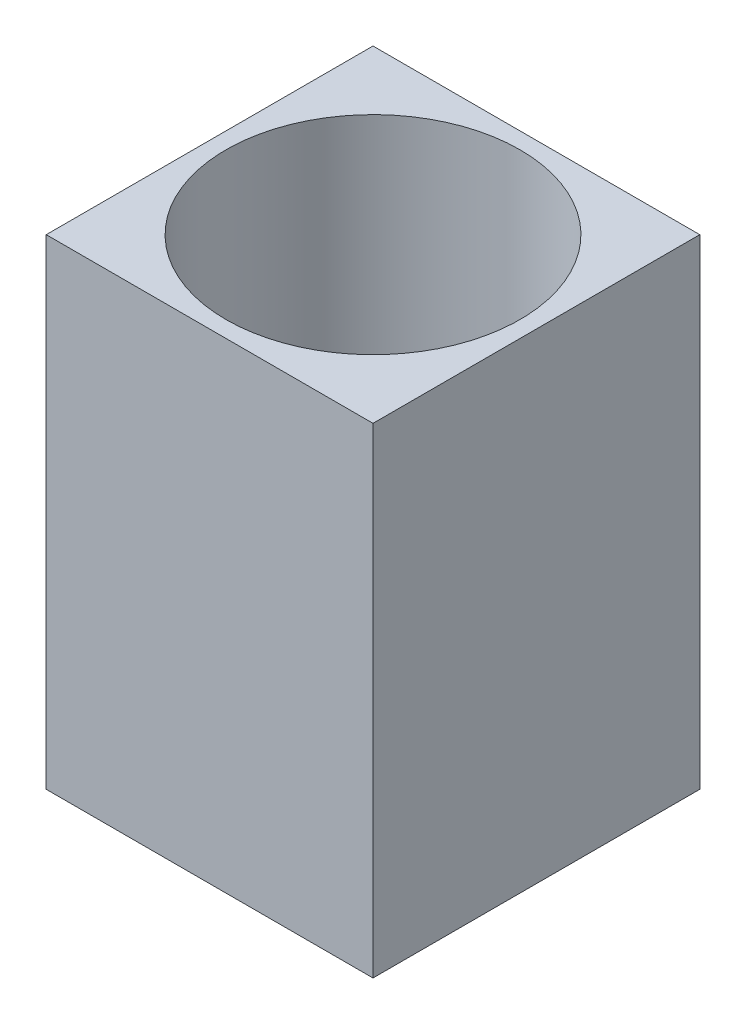
ISO-10303-21;
HEADER;
FILE_DESCRIPTION(('STEP AP214'),'2;1');
FILE_NAME('part.step','',(''),(''),'','','');
FILE_SCHEMA(('AUTOMOTIVE_DESIGN { 1 0 10303 214 1 1 1 1 }'));
ENDSEC;
DATA;
#1=APPLICATION_CONTEXT('core data for automotive mechanical design processes');
#2=APPLICATION_PROTOCOL_DEFINITION('international standard','automotive_design',2000,#1);
#3=PRODUCT_CONTEXT('',#1,'mechanical');
#4=PRODUCT('Part','Part','',(#3));
#5=PRODUCT_RELATED_PRODUCT_CATEGORY('part','',(#4));
#6=PRODUCT_DEFINITION_FORMATION('','',#4);
#7=PRODUCT_DEFINITION_CONTEXT('part definition',#1,'design');
#8=PRODUCT_DEFINITION('design','',#6,#7);
#9=PRODUCT_DEFINITION_SHAPE('','',#8);
#10=(LENGTH_UNIT() NAMED_UNIT(*) SI_UNIT(.MILLI.,.METRE.));
#11=(NAMED_UNIT(*) PLANE_ANGLE_UNIT() SI_UNIT($,.RADIAN.));
#12=(NAMED_UNIT(*) SI_UNIT($,.STERADIAN.) SOLID_ANGLE_UNIT());
#13=UNCERTAINTY_MEASURE_WITH_UNIT(LENGTH_MEASURE(1.E-05),#10,'distance_accuracy_value','');
#14=(GEOMETRIC_REPRESENTATION_CONTEXT(3) GLOBAL_UNCERTAINTY_ASSIGNED_CONTEXT((#13)) GLOBAL_UNIT_ASSIGNED_CONTEXT((#10,
#11,#12)) REPRESENTATION_CONTEXT('',''));
#15=CARTESIAN_POINT('',(0.,0.,0.));
#16=DIRECTION('',(0.,0.,1.));
#17=DIRECTION('',(1.,0.,0.));
#18=AXIS2_PLACEMENT_3D('',#15,#16,#17);
#19=CARTESIAN_POINT('',(5.,3.,5.));
#20=DIRECTION('',(0.,-1.,0.));
#21=DIRECTION('',(0.,0.,-1.));
#22=AXIS2_PLACEMENT_3D('',#19,#20,#21);
#23=CYLINDRICAL_SURFACE('',#22,3.5);
#24=CARTESIAN_POINT('',(5.,3.,5.));
#25=DIRECTION('',(0.,-1.,0.));
#26=DIRECTION('',(0.,0.,-1.));
#27=AXIS2_PLACEMENT_3D('',#24,#25,#26);
#28=CIRCLE('',#27,3.5);
#29=CARTESIAN_POINT('',(5.,3.,1.5));
#30=VERTEX_POINT('',#29);
#31=EDGE_CURVE('E232',#30,#30,#28,.T.);
#32=ORIENTED_EDGE('',*,*,#31,.F.);
#33=EDGE_LOOP('',(#32));
#34=FACE_BOUND('',#33,.T.);
#35=CARTESIAN_POINT('',(5.,2.,5.));
#36=DIRECTION('',(0.,-1.,0.));
#37=DIRECTION('',(0.,0.,-1.));
#38=AXIS2_PLACEMENT_3D('',#35,#36,#37);
#39=CIRCLE('',#38,3.5);
#40=CARTESIAN_POINT('',(5.,2.,1.5));
#41=VERTEX_POINT('',#40);
#42=EDGE_CURVE('E50',#41,#41,#39,.F.);
#43=ORIENTED_EDGE('',*,*,#42,.F.);
#44=EDGE_LOOP('',(#43));
#45=FACE_BOUND('',#44,.T.);
#46=ADVANCED_FACE('F46',(#34,#45),#23,.F.);
#47=CARTESIAN_POINT('',(0.,14.7,0.));
#48=DIRECTION('',(0.,1.,0.));
#49=DIRECTION('',(0.,0.,1.));
#50=AXIS2_PLACEMENT_3D('',#47,#48,#49);
#51=PLANE('',#50);
#52=DIRECTION('',(0.,0.,1.));
#53=VECTOR('',#52,1.);
#54=CARTESIAN_POINT('',(0.,14.7,0.));
#55=LINE('',#54,#53);
#56=CARTESIAN_POINT('',(0.,14.7,0.));
#57=VERTEX_POINT('',#56);
#58=CARTESIAN_POINT('',(0.,14.7,10.));
#59=VERTEX_POINT('',#58);
#60=EDGE_CURVE('E99',#57,#59,#55,.T.);
#61=ORIENTED_EDGE('',*,*,#60,.T.);
#62=DIRECTION('',(1.,0.,0.));
#63=VECTOR('',#62,1.);
#64=CARTESIAN_POINT('',(0.,14.7,10.));
#65=LINE('',#64,#63);
#66=CARTESIAN_POINT('',(10.,14.7,10.));
#67=VERTEX_POINT('',#66);
#68=EDGE_CURVE('E94',#59,#67,#65,.T.);
#69=ORIENTED_EDGE('',*,*,#68,.T.);
#70=DIRECTION('',(0.,0.,-1.));
#71=VECTOR('',#70,1.);
#72=CARTESIAN_POINT('',(10.,14.7,0.));
#73=LINE('',#72,#71);
#74=CARTESIAN_POINT('',(10.,14.7,0.));
#75=VERTEX_POINT('',#74);
#76=EDGE_CURVE('E98',#67,#75,#73,.T.);
#77=ORIENTED_EDGE('',*,*,#76,.T.);
#78=DIRECTION('',(-1.,0.,0.));
#79=VECTOR('',#78,1.);
#80=CARTESIAN_POINT('',(0.,14.7,0.));
#81=LINE('',#80,#79);
#82=EDGE_CURVE('E65',#75,#57,#81,.T.);
#83=ORIENTED_EDGE('',*,*,#82,.T.);
#84=EDGE_LOOP('',(#61,#69,#77,#83));
#85=FACE_BOUND('',#84,.T.);
#86=CARTESIAN_POINT('',(5.,14.7,5.));
#87=DIRECTION('',(0.,1.,0.));
#88=DIRECTION('',(0.,0.,1.));
#89=AXIS2_PLACEMENT_3D('',#86,#87,#88);
#90=CIRCLE('',#89,4.5);
#91=CARTESIAN_POINT('',(5.,14.7,9.5));
#92=VERTEX_POINT('',#91);
#93=EDGE_CURVE('E122',#92,#92,#90,.T.);
#94=ORIENTED_EDGE('',*,*,#93,.F.);
#95=EDGE_LOOP('',(#94));
#96=FACE_BOUND('',#95,.T.);
#97=ADVANCED_FACE('F95',(#85,#96),#51,.T.);
#98=CARTESIAN_POINT('',(0.,0.,0.));
#99=DIRECTION('',(0.,1.,0.));
#100=DIRECTION('',(0.,0.,1.));
#101=AXIS2_PLACEMENT_3D('',#98,#99,#100);
#102=PLANE('',#101);
#103=CARTESIAN_POINT('',(5.,0.,5.));
#104=DIRECTION('',(0.,-1.,0.));
#105=DIRECTION('',(0.,0.,-1.));
#106=AXIS2_PLACEMENT_3D('',#103,#104,#105);
#107=CIRCLE('',#106,4.5);
#108=CARTESIAN_POINT('',(5.,0.,0.5));
#109=VERTEX_POINT('',#108);
#110=EDGE_CURVE('E226',#109,#109,#107,.T.);
#111=ORIENTED_EDGE('',*,*,#110,.F.);
#112=EDGE_LOOP('',(#111));
#113=FACE_BOUND('',#112,.T.);
#114=DIRECTION('',(0.,0.,1.));
#115=VECTOR('',#114,1.);
#116=CARTESIAN_POINT('',(0.,0.,0.));
#117=LINE('',#116,#115);
#118=CARTESIAN_POINT('',(0.,0.,0.));
#119=VERTEX_POINT('',#118);
#120=CARTESIAN_POINT('',(0.,0.,10.));
#121=VERTEX_POINT('',#120);
#122=EDGE_CURVE('E119',#119,#121,#117,.T.);
#123=ORIENTED_EDGE('',*,*,#122,.F.);
#124=DIRECTION('',(-1.,0.,0.));
#125=VECTOR('',#124,1.);
#126=CARTESIAN_POINT('',(0.,0.,0.));
#127=LINE('',#126,#125);
#128=CARTESIAN_POINT('',(10.,0.,0.));
#129=VERTEX_POINT('',#128);
#130=EDGE_CURVE('E128',#129,#119,#127,.T.);
#131=ORIENTED_EDGE('',*,*,#130,.F.);
#132=DIRECTION('',(0.,0.,-1.));
#133=VECTOR('',#132,1.);
#134=CARTESIAN_POINT('',(10.,0.,0.));
#135=LINE('',#134,#133);
#136=CARTESIAN_POINT('',(10.,0.,10.));
#137=VERTEX_POINT('',#136);
#138=EDGE_CURVE('E125',#137,#129,#135,.T.);
#139=ORIENTED_EDGE('',*,*,#138,.F.);
#140=DIRECTION('',(1.,0.,0.));
#141=VECTOR('',#140,1.);
#142=CARTESIAN_POINT('',(0.,0.,10.));
#143=LINE('',#142,#141);
#144=EDGE_CURVE('E107',#121,#137,#143,.T.);
#145=ORIENTED_EDGE('',*,*,#144,.F.);
#146=EDGE_LOOP('',(#123,#131,#139,#145));
#147=FACE_BOUND('',#146,.T.);
#148=ADVANCED_FACE('F138',(#113,#147),#102,.F.);
#149=CARTESIAN_POINT('',(0.,14.7,0.));
#150=DIRECTION('',(1.,0.,0.));
#151=DIRECTION('',(0.,0.,-1.));
#152=AXIS2_PLACEMENT_3D('',#149,#150,#151);
#153=PLANE('',#152);
#154=DIRECTION('',(0.,-1.,0.));
#155=VECTOR('',#154,1.);
#156=CARTESIAN_POINT('',(0.,14.7,0.));
#157=LINE('',#156,#155);
#158=EDGE_CURVE('E88',#57,#119,#157,.T.);
#159=ORIENTED_EDGE('',*,*,#158,.T.);
#160=ORIENTED_EDGE('',*,*,#122,.T.);
#161=DIRECTION('',(0.,-1.,0.));
#162=VECTOR('',#161,1.);
#163=CARTESIAN_POINT('',(0.,14.7,10.));
#164=LINE('',#163,#162);
#165=EDGE_CURVE('E57',#59,#121,#164,.T.);
#166=ORIENTED_EDGE('',*,*,#165,.F.);
#167=ORIENTED_EDGE('',*,*,#60,.F.);
#168=EDGE_LOOP('',(#159,#160,#166,#167));
#169=FACE_BOUND('',#168,.T.);
#170=ADVANCED_FACE('F48',(#169),#153,.F.);
#171=CARTESIAN_POINT('',(0.,14.7,10.));
#172=DIRECTION('',(0.,0.,-1.));
#173=DIRECTION('',(-1.,0.,0.));
#174=AXIS2_PLACEMENT_3D('',#171,#172,#173);
#175=PLANE('',#174);
#176=ORIENTED_EDGE('',*,*,#165,.T.);
#177=ORIENTED_EDGE('',*,*,#144,.T.);
#178=DIRECTION('',(0.,-1.,0.));
#179=VECTOR('',#178,1.);
#180=CARTESIAN_POINT('',(10.,14.7,10.));
#181=LINE('',#180,#179);
#182=EDGE_CURVE('E104',#67,#137,#181,.T.);
#183=ORIENTED_EDGE('',*,*,#182,.F.);
#184=ORIENTED_EDGE('',*,*,#68,.F.);
#185=EDGE_LOOP('',(#176,#177,#183,#184));
#186=FACE_BOUND('',#185,.T.);
#187=ADVANCED_FACE('F105',(#186),#175,.F.);
#188=CARTESIAN_POINT('',(10.,14.7,0.));
#189=DIRECTION('',(-1.,0.,0.));
#190=DIRECTION('',(0.,0.,1.));
#191=AXIS2_PLACEMENT_3D('',#188,#189,#190);
#192=PLANE('',#191);
#193=ORIENTED_EDGE('',*,*,#182,.T.);
#194=ORIENTED_EDGE('',*,*,#138,.T.);
#195=DIRECTION('',(0.,-1.,0.));
#196=VECTOR('',#195,1.);
#197=CARTESIAN_POINT('',(10.,14.7,0.));
#198=LINE('',#197,#196);
#199=EDGE_CURVE('E81',#75,#129,#198,.T.);
#200=ORIENTED_EDGE('',*,*,#199,.F.);
#201=ORIENTED_EDGE('',*,*,#76,.F.);
#202=EDGE_LOOP('',(#193,#194,#200,#201));
#203=FACE_BOUND('',#202,.T.);
#204=ADVANCED_FACE('F112',(#203),#192,.F.);
#205=CARTESIAN_POINT('',(0.,14.7,0.));
#206=DIRECTION('',(0.,0.,1.));
#207=DIRECTION('',(1.,0.,0.));
#208=AXIS2_PLACEMENT_3D('',#205,#206,#207);
#209=PLANE('',#208);
#210=ORIENTED_EDGE('',*,*,#199,.T.);
#211=ORIENTED_EDGE('',*,*,#130,.T.);
#212=ORIENTED_EDGE('',*,*,#158,.F.);
#213=ORIENTED_EDGE('',*,*,#82,.F.);
#214=EDGE_LOOP('',(#210,#211,#212,#213));
#215=FACE_BOUND('',#214,.T.);
#216=ADVANCED_FACE('F167',(#215),#209,.F.);
#217=CARTESIAN_POINT('',(5.,14.7,5.));
#218=DIRECTION('',(0.,-1.,0.));
#219=DIRECTION('',(0.,0.,-1.));
#220=AXIS2_PLACEMENT_3D('',#217,#218,#219);
#221=CYLINDRICAL_SURFACE('',#220,4.5);
#222=CARTESIAN_POINT('',(5.,3.,5.));
#223=DIRECTION('',(0.,1.,0.));
#224=DIRECTION('',(0.,0.,1.));
#225=AXIS2_PLACEMENT_3D('',#222,#223,#224);
#226=CIRCLE('',#225,4.5);
#227=CARTESIAN_POINT('',(5.,3.,9.5));
#228=VERTEX_POINT('',#227);
#229=EDGE_CURVE('E12',#228,#228,#226,.T.);
#230=ORIENTED_EDGE('',*,*,#229,.F.);
#231=EDGE_LOOP('',(#230));
#232=FACE_BOUND('',#231,.T.);
#233=ORIENTED_EDGE('',*,*,#93,.T.);
#234=EDGE_LOOP('',(#233));
#235=FACE_BOUND('',#234,.T.);
#236=ADVANCED_FACE('F164',(#232,#235),#221,.F.);
#237=CARTESIAN_POINT('',(0.,3.,0.));
#238=DIRECTION('',(0.,1.,0.));
#239=DIRECTION('',(0.,0.,1.));
#240=AXIS2_PLACEMENT_3D('',#237,#238,#239);
#241=PLANE('',#240);
#242=ORIENTED_EDGE('',*,*,#31,.T.);
#243=EDGE_LOOP('',(#242));
#244=FACE_BOUND('',#243,.T.);
#245=ORIENTED_EDGE('',*,*,#229,.T.);
#246=EDGE_LOOP('',(#245));
#247=FACE_BOUND('',#246,.T.);
#248=ADVANCED_FACE('F161',(#244,#247),#241,.T.);
#249=CARTESIAN_POINT('',(5.,2.,5.));
#250=DIRECTION('',(0.,-1.,0.));
#251=DIRECTION('',(0.,0.,-1.));
#252=AXIS2_PLACEMENT_3D('',#249,#250,#251);
#253=PLANE('',#252);
#254=CARTESIAN_POINT('',(5.,2.,5.));
#255=DIRECTION('',(0.,-1.,0.));
#256=DIRECTION('',(0.,0.,-1.));
#257=AXIS2_PLACEMENT_3D('',#254,#255,#256);
#258=CIRCLE('',#257,4.5);
#259=CARTESIAN_POINT('',(5.,2.,0.5));
#260=VERTEX_POINT('',#259);
#261=EDGE_CURVE('E223',#260,#260,#258,.T.);
#262=ORIENTED_EDGE('',*,*,#261,.T.);
#263=EDGE_LOOP('',(#262));
#264=FACE_BOUND('',#263,.T.);
#265=ORIENTED_EDGE('',*,*,#42,.T.);
#266=EDGE_LOOP('',(#265));
#267=FACE_BOUND('',#266,.T.);
#268=ADVANCED_FACE('F163',(#264,#267),#253,.T.);
#269=CARTESIAN_POINT('',(5.,2.,5.));
#270=DIRECTION('',(0.,-1.,0.));
#271=DIRECTION('',(0.,0.,-1.));
#272=AXIS2_PLACEMENT_3D('',#269,#270,#271);
#273=CYLINDRICAL_SURFACE('',#272,4.5);
#274=ORIENTED_EDGE('',*,*,#261,.F.);
#275=EDGE_LOOP('',(#274));
#276=FACE_BOUND('',#275,.T.);
#277=ORIENTED_EDGE('',*,*,#110,.T.);
#278=EDGE_LOOP('',(#277));
#279=FACE_BOUND('',#278,.T.);
#280=ADVANCED_FACE('F159',(#276,#279),#273,.F.);
#281=CLOSED_SHELL('',(#46,#97,#148,#170,#187,#204,#216,#236,#248,#268,#280));
#282=MANIFOLD_SOLID_BREP('B2',#281);
#283=ADVANCED_BREP_SHAPE_REPRESENTATION('',(#18,#282),#14);
#284=SHAPE_DEFINITION_REPRESENTATION(#9,#283);
ENDSEC;
END-ISO-10303-21;
